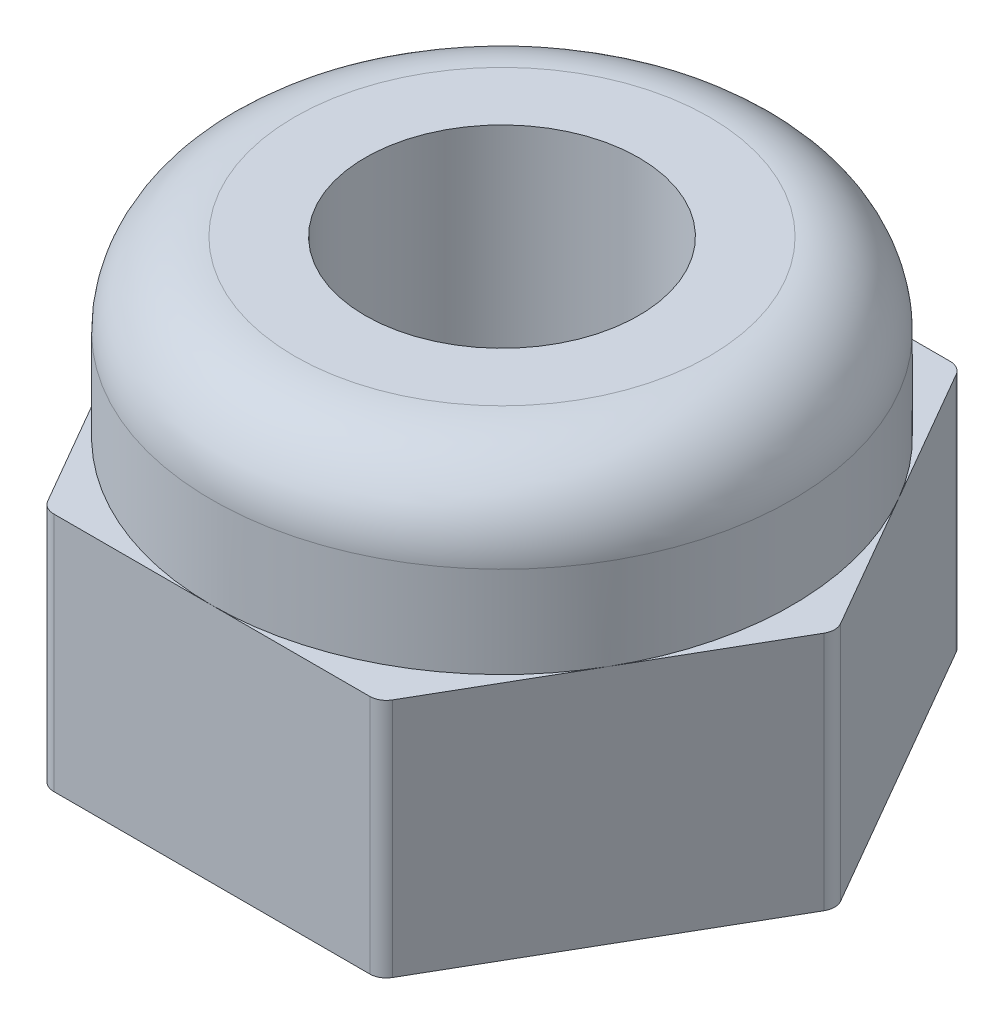
ISO-10303-21;
HEADER;
FILE_DESCRIPTION(('STEP AP214'),'2;1');
FILE_NAME('part.step','',(''),(''),'','','');
FILE_SCHEMA(('AUTOMOTIVE_DESIGN { 1 0 10303 214 1 1 1 1 }'));
ENDSEC;
DATA;
#1=APPLICATION_CONTEXT('core data for automotive mechanical design processes');
#2=APPLICATION_PROTOCOL_DEFINITION('international standard','automotive_design',2000,#1);
#3=PRODUCT_CONTEXT('',#1,'mechanical');
#4=PRODUCT('Part','Part','',(#3));
#5=PRODUCT_RELATED_PRODUCT_CATEGORY('part','',(#4));
#6=PRODUCT_DEFINITION_FORMATION('','',#4);
#7=PRODUCT_DEFINITION_CONTEXT('part definition',#1,'design');
#8=PRODUCT_DEFINITION('design','',#6,#7);
#9=PRODUCT_DEFINITION_SHAPE('','',#8);
#10=(LENGTH_UNIT() NAMED_UNIT(*) SI_UNIT(.MILLI.,.METRE.));
#11=(NAMED_UNIT(*) PLANE_ANGLE_UNIT() SI_UNIT($,.RADIAN.));
#12=(NAMED_UNIT(*) SI_UNIT($,.STERADIAN.) SOLID_ANGLE_UNIT());
#13=UNCERTAINTY_MEASURE_WITH_UNIT(LENGTH_MEASURE(1.E-05),#10,'distance_accuracy_value','');
#14=(GEOMETRIC_REPRESENTATION_CONTEXT(3) GLOBAL_UNCERTAINTY_ASSIGNED_CONTEXT((#13)) GLOBAL_UNIT_ASSIGNED_CONTEXT((#10,
#11,#12)) REPRESENTATION_CONTEXT('',''));
#15=CARTESIAN_POINT('',(0.,0.,0.));
#16=DIRECTION('',(0.,0.,1.));
#17=DIRECTION('',(1.,0.,0.));
#18=AXIS2_PLACEMENT_3D('',#15,#16,#17);
#19=CARTESIAN_POINT('',(0.,2.9,0.));
#20=DIRECTION('',(0.,1.,0.));
#21=DIRECTION('',(0.,0.,1.));
#22=AXIS2_PLACEMENT_3D('',#19,#20,#21);
#23=PLANE('',#22);
#24=DIRECTION('',(1.,0.,0.));
#25=VECTOR('',#24,1.);
#26=CARTESIAN_POINT('',(-2.02072594216366,2.9,3.50000000000002));
#27=LINE('',#26,#25);
#28=CARTESIAN_POINT('',(0.,2.9,3.5));
#29=VERTEX_POINT('',#28);
#30=CARTESIAN_POINT('',(1.90525588832581,2.9,3.49999999999998));
#31=VERTEX_POINT('',#30);
#32=EDGE_CURVE('E159',#29,#31,#27,.T.);
#33=ORIENTED_EDGE('',*,*,#32,.T.);
#34=CARTESIAN_POINT('',(1.90525588832581,2.9,3.29999999999998));
#35=DIRECTION('',(0.,1.,0.));
#36=DIRECTION('',(0.,0.,1.));
#37=AXIS2_PLACEMENT_3D('',#34,#35,#36);
#38=CIRCLE('',#37,0.2);
#39=CARTESIAN_POINT('',(2.07846096908269,2.9,3.39999999999998));
#40=VERTEX_POINT('',#39);
#41=EDGE_CURVE('E11',#31,#40,#38,.T.);
#42=ORIENTED_EDGE('',*,*,#41,.T.);
#43=DIRECTION('',(0.499999999999995,0.,-0.866025403784442));
#44=VECTOR('',#43,1.);
#45=CARTESIAN_POINT('',(2.02072594216373,2.9,3.49999999999998));
#46=LINE('',#45,#44);
#47=CARTESIAN_POINT('',(3.03108891324556,2.9,1.74999999999999));
#48=VERTEX_POINT('',#47);
#49=EDGE_CURVE('E169',#40,#48,#46,.T.);
#50=ORIENTED_EDGE('',*,*,#49,.T.);
#51=CARTESIAN_POINT('',(0.,2.9,0.));
#52=DIRECTION('',(0.,1.,0.));
#53=DIRECTION('',(0.,0.,1.));
#54=AXIS2_PLACEMENT_3D('',#51,#52,#53);
#55=CIRCLE('',#54,3.50000000000002);
#56=EDGE_CURVE('E168',#29,#48,#55,.T.);
#57=ORIENTED_EDGE('',*,*,#56,.F.);
#58=EDGE_LOOP('',(#33,#42,#50,#57));
#59=FACE_BOUND('',#58,.T.);
#60=ADVANCED_FACE('F38',(#59),#23,.T.);
#61=CARTESIAN_POINT('',(3.98371685740842,2.9,0.0999999999999994));
#62=VERTEX_POINT('',#61);
#63=EDGE_CURVE('E190',#48,#62,#46,.T.);
#64=ORIENTED_EDGE('',*,*,#63,.T.);
#65=CARTESIAN_POINT('',(3.81051177665153,2.9,0.));
#66=DIRECTION('',(0.,1.,0.));
#67=DIRECTION('',(0.,0.,1.));
#68=AXIS2_PLACEMENT_3D('',#65,#66,#67);
#69=CIRCLE('',#68,0.2);
#70=CARTESIAN_POINT('',(3.98371685740842,2.9,-0.0999999999999996));
#71=VERTEX_POINT('',#70);
#72=EDGE_CURVE('E46',#62,#71,#69,.T.);
#73=ORIENTED_EDGE('',*,*,#72,.T.);
#74=DIRECTION('',(-0.500000000000001,0.,-0.866025403784438));
#75=VECTOR('',#74,1.);
#76=CARTESIAN_POINT('',(4.04145188432738,2.9,0.));
#77=LINE('',#76,#75);
#78=CARTESIAN_POINT('',(3.03108891324553,2.9,-1.75));
#79=VERTEX_POINT('',#78);
#80=EDGE_CURVE('E191',#71,#79,#77,.T.);
#81=ORIENTED_EDGE('',*,*,#80,.T.);
#82=EDGE_CURVE('E174',#48,#79,#55,.T.);
#83=ORIENTED_EDGE('',*,*,#82,.F.);
#84=EDGE_LOOP('',(#64,#73,#81,#83));
#85=FACE_BOUND('',#84,.T.);
#86=ADVANCED_FACE('F269',(#85),#23,.T.);
#87=CARTESIAN_POINT('',(2.07846096908265,2.9,-3.40000000000001));
#88=VERTEX_POINT('',#87);
#89=EDGE_CURVE('E189',#79,#88,#77,.T.);
#90=ORIENTED_EDGE('',*,*,#89,.T.);
#91=CARTESIAN_POINT('',(1.90525588832576,2.9,-3.30000000000001));
#92=DIRECTION('',(0.,1.,0.));
#93=DIRECTION('',(0.,0.,1.));
#94=AXIS2_PLACEMENT_3D('',#91,#92,#93);
#95=CIRCLE('',#94,0.2);
#96=CARTESIAN_POINT('',(1.90525588832576,2.9,-3.50000000000001));
#97=VERTEX_POINT('',#96);
#98=EDGE_CURVE('E261',#88,#97,#95,.T.);
#99=ORIENTED_EDGE('',*,*,#98,.T.);
#100=DIRECTION('',(-1.,0.,0.));
#101=VECTOR('',#100,1.);
#102=CARTESIAN_POINT('',(2.02072594216368,2.9,-3.50000000000001));
#103=LINE('',#102,#101);
#104=CARTESIAN_POINT('',(0.,2.9,-3.5));
#105=VERTEX_POINT('',#104);
#106=EDGE_CURVE('E194',#97,#105,#103,.T.);
#107=ORIENTED_EDGE('',*,*,#106,.T.);
#108=EDGE_CURVE('E323',#79,#105,#55,.T.);
#109=ORIENTED_EDGE('',*,*,#108,.F.);
#110=EDGE_LOOP('',(#90,#99,#107,#109));
#111=FACE_BOUND('',#110,.T.);
#112=ADVANCED_FACE('F321',(#111),#23,.T.);
#113=CARTESIAN_POINT('',(-1.90525588832578,2.9,-3.49999999999999));
#114=VERTEX_POINT('',#113);
#115=EDGE_CURVE('E193',#105,#114,#103,.T.);
#116=ORIENTED_EDGE('',*,*,#115,.T.);
#117=CARTESIAN_POINT('',(-1.90525588832578,2.9,-3.29999999999999));
#118=DIRECTION('',(0.,1.,0.));
#119=DIRECTION('',(0.,0.,1.));
#120=AXIS2_PLACEMENT_3D('',#117,#118,#119);
#121=CIRCLE('',#120,0.2);
#122=CARTESIAN_POINT('',(-2.07846096908267,2.9,-3.39999999999999));
#123=VERTEX_POINT('',#122);
#124=EDGE_CURVE('E254',#114,#123,#121,.T.);
#125=ORIENTED_EDGE('',*,*,#124,.T.);
#126=DIRECTION('',(-0.499999999999995,0.,0.866025403784442));
#127=VECTOR('',#126,1.);
#128=CARTESIAN_POINT('',(-2.02072594216371,2.9,-3.49999999999999));
#129=LINE('',#128,#127);
#130=CARTESIAN_POINT('',(-3.03108891324555,2.9,-1.74999999999998));
#131=VERTEX_POINT('',#130);
#132=EDGE_CURVE('E197',#123,#131,#129,.T.);
#133=ORIENTED_EDGE('',*,*,#132,.T.);
#134=EDGE_CURVE('E182',#105,#131,#55,.T.);
#135=ORIENTED_EDGE('',*,*,#134,.F.);
#136=EDGE_LOOP('',(#116,#125,#133,#135));
#137=FACE_BOUND('',#136,.T.);
#138=ADVANCED_FACE('F326',(#137),#23,.T.);
#139=CARTESIAN_POINT('',(-3.98371685740842,2.9,-0.0999999999999729));
#140=VERTEX_POINT('',#139);
#141=EDGE_CURVE('E196',#131,#140,#129,.T.);
#142=ORIENTED_EDGE('',*,*,#141,.T.);
#143=CARTESIAN_POINT('',(-3.81051177665153,2.9,0.));
#144=DIRECTION('',(0.,1.,0.));
#145=DIRECTION('',(0.,0.,1.));
#146=AXIS2_PLACEMENT_3D('',#143,#144,#145);
#147=CIRCLE('',#146,0.2);
#148=CARTESIAN_POINT('',(-3.98371685740842,2.9,0.100000000000028));
#149=VERTEX_POINT('',#148);
#150=EDGE_CURVE('E247',#140,#149,#147,.T.);
#151=ORIENTED_EDGE('',*,*,#150,.T.);
#152=DIRECTION('',(0.500000000000007,0.,0.866025403784435));
#153=VECTOR('',#152,1.);
#154=CARTESIAN_POINT('',(-4.04145188432738,2.9,0.));
#155=LINE('',#154,#153);
#156=CARTESIAN_POINT('',(-3.03108891324552,2.9,1.75000000000002));
#157=VERTEX_POINT('',#156);
#158=EDGE_CURVE('E166',#149,#157,#155,.T.);
#159=ORIENTED_EDGE('',*,*,#158,.T.);
#160=EDGE_CURVE('E180',#131,#157,#55,.T.);
#161=ORIENTED_EDGE('',*,*,#160,.F.);
#162=EDGE_LOOP('',(#142,#151,#159,#161));
#163=FACE_BOUND('',#162,.T.);
#164=ADVANCED_FACE('F328',(#163),#23,.T.);
#165=CARTESIAN_POINT('',(2.02072594216373,2.9,3.49999999999998));
#166=DIRECTION('',(-0.866025403784442,0.,-0.499999999999995));
#167=DIRECTION('',(-0.499999999999995,0.,0.866025403784442));
#168=AXIS2_PLACEMENT_3D('',#165,#166,#167);
#169=PLANE('',#168);
#170=DIRECTION('',(0.499999999999995,0.,-0.866025403784442));
#171=VECTOR('',#170,1.);
#172=CARTESIAN_POINT('',(2.02072594216373,0.,3.49999999999998));
#173=LINE('',#172,#171);
#174=CARTESIAN_POINT('',(2.07846096908269,0.,3.39999999999998));
#175=VERTEX_POINT('',#174);
#176=CARTESIAN_POINT('',(3.98371685740842,0.,0.0999999999999994));
#177=VERTEX_POINT('',#176);
#178=EDGE_CURVE('E173',#175,#177,#173,.T.);
#179=ORIENTED_EDGE('',*,*,#178,.T.);
#180=DIRECTION('',(0.,-1.,0.));
#181=VECTOR('',#180,1.);
#182=CARTESIAN_POINT('',(3.98371685740842,2.9,0.0999999999999994));
#183=LINE('',#182,#181);
#184=EDGE_CURVE('E59',#177,#62,#183,.F.);
#185=ORIENTED_EDGE('',*,*,#184,.T.);
#186=ORIENTED_EDGE('',*,*,#63,.F.);
#187=ORIENTED_EDGE('',*,*,#49,.F.);
#188=DIRECTION('',(0.,-1.,0.));
#189=VECTOR('',#188,1.);
#190=CARTESIAN_POINT('',(2.07846096908269,2.9,3.39999999999998));
#191=LINE('',#190,#189);
#192=EDGE_CURVE('E263',#40,#175,#191,.T.);
#193=ORIENTED_EDGE('',*,*,#192,.T.);
#194=EDGE_LOOP('',(#179,#185,#186,#187,#193));
#195=FACE_BOUND('',#194,.T.);
#196=ADVANCED_FACE('F283',(#195),#169,.F.);
#197=CARTESIAN_POINT('',(4.04145188432738,2.9,0.));
#198=DIRECTION('',(-0.866025403784438,0.,0.500000000000001));
#199=DIRECTION('',(0.500000000000001,0.,0.866025403784438));
#200=AXIS2_PLACEMENT_3D('',#197,#198,#199);
#201=PLANE('',#200);
#202=DIRECTION('',(-0.500000000000001,0.,-0.866025403784438));
#203=VECTOR('',#202,1.);
#204=CARTESIAN_POINT('',(4.04145188432738,0.,0.));
#205=LINE('',#204,#203);
#206=CARTESIAN_POINT('',(3.98371685740842,0.,-0.0999999999999996));
#207=VERTEX_POINT('',#206);
#208=CARTESIAN_POINT('',(2.07846096908265,0.,-3.40000000000001));
#209=VERTEX_POINT('',#208);
#210=EDGE_CURVE('E202',#207,#209,#205,.T.);
#211=ORIENTED_EDGE('',*,*,#210,.T.);
#212=DIRECTION('',(0.,-1.,0.));
#213=VECTOR('',#212,1.);
#214=CARTESIAN_POINT('',(2.07846096908265,2.9,-3.40000000000001));
#215=LINE('',#214,#213);
#216=EDGE_CURVE('E259',#209,#88,#215,.F.);
#217=ORIENTED_EDGE('',*,*,#216,.T.);
#218=ORIENTED_EDGE('',*,*,#89,.F.);
#219=ORIENTED_EDGE('',*,*,#80,.F.);
#220=DIRECTION('',(0.,-1.,0.));
#221=VECTOR('',#220,1.);
#222=CARTESIAN_POINT('',(3.98371685740842,2.9,-0.0999999999999996));
#223=LINE('',#222,#221);
#224=EDGE_CURVE('E256',#71,#207,#223,.T.);
#225=ORIENTED_EDGE('',*,*,#224,.T.);
#226=EDGE_LOOP('',(#211,#217,#218,#219,#225));
#227=FACE_BOUND('',#226,.T.);
#228=ADVANCED_FACE('F275',(#227),#201,.F.);
#229=CARTESIAN_POINT('',(2.02072594216368,2.9,-3.50000000000001));
#230=DIRECTION('',(0.,0.,1.));
#231=DIRECTION('',(1.,0.,0.));
#232=AXIS2_PLACEMENT_3D('',#229,#230,#231);
#233=PLANE('',#232);
#234=DIRECTION('',(-1.,0.,0.));
#235=VECTOR('',#234,1.);
#236=CARTESIAN_POINT('',(2.02072594216368,0.,-3.50000000000001));
#237=LINE('',#236,#235);
#238=CARTESIAN_POINT('',(1.90525588832576,0.,-3.50000000000001));
#239=VERTEX_POINT('',#238);
#240=CARTESIAN_POINT('',(-1.90525588832578,0.,-3.49999999999999));
#241=VERTEX_POINT('',#240);
#242=EDGE_CURVE('E205',#239,#241,#237,.T.);
#243=ORIENTED_EDGE('',*,*,#242,.T.);
#244=DIRECTION('',(0.,-1.,0.));
#245=VECTOR('',#244,1.);
#246=CARTESIAN_POINT('',(-1.90525588832578,2.9,-3.49999999999999));
#247=LINE('',#246,#245);
#248=EDGE_CURVE('E252',#241,#114,#247,.F.);
#249=ORIENTED_EDGE('',*,*,#248,.T.);
#250=ORIENTED_EDGE('',*,*,#115,.F.);
#251=ORIENTED_EDGE('',*,*,#106,.F.);
#252=DIRECTION('',(0.,-1.,0.));
#253=VECTOR('',#252,1.);
#254=CARTESIAN_POINT('',(1.90525588832576,2.9,-3.50000000000001));
#255=LINE('',#254,#253);
#256=EDGE_CURVE('E249',#97,#239,#255,.T.);
#257=ORIENTED_EDGE('',*,*,#256,.T.);
#258=EDGE_LOOP('',(#243,#249,#250,#251,#257));
#259=FACE_BOUND('',#258,.T.);
#260=ADVANCED_FACE('F311',(#259),#233,.F.);
#261=CARTESIAN_POINT('',(-2.02072594216371,2.9,-3.49999999999999));
#262=DIRECTION('',(0.866025403784442,0.,0.499999999999995));
#263=DIRECTION('',(0.499999999999995,0.,-0.866025403784442));
#264=AXIS2_PLACEMENT_3D('',#261,#262,#263);
#265=PLANE('',#264);
#266=DIRECTION('',(-0.499999999999995,0.,0.866025403784442));
#267=VECTOR('',#266,1.);
#268=CARTESIAN_POINT('',(-2.02072594216371,0.,-3.49999999999999));
#269=LINE('',#268,#267);
#270=CARTESIAN_POINT('',(-2.07846096908267,0.,-3.39999999999999));
#271=VERTEX_POINT('',#270);
#272=CARTESIAN_POINT('',(-3.98371685740842,0.,-0.0999999999999729));
#273=VERTEX_POINT('',#272);
#274=EDGE_CURVE('E208',#271,#273,#269,.T.);
#275=ORIENTED_EDGE('',*,*,#274,.T.);
#276=DIRECTION('',(0.,-1.,0.));
#277=VECTOR('',#276,1.);
#278=CARTESIAN_POINT('',(-3.98371685740842,2.9,-0.0999999999999725));
#279=LINE('',#278,#277);
#280=EDGE_CURVE('E245',#273,#140,#279,.F.);
#281=ORIENTED_EDGE('',*,*,#280,.T.);
#282=ORIENTED_EDGE('',*,*,#141,.F.);
#283=ORIENTED_EDGE('',*,*,#132,.F.);
#284=DIRECTION('',(0.,-1.,0.));
#285=VECTOR('',#284,1.);
#286=CARTESIAN_POINT('',(-2.07846096908267,2.9,-3.39999999999999));
#287=LINE('',#286,#285);
#288=EDGE_CURVE('E242',#123,#271,#287,.T.);
#289=ORIENTED_EDGE('',*,*,#288,.T.);
#290=EDGE_LOOP('',(#275,#281,#282,#283,#289));
#291=FACE_BOUND('',#290,.T.);
#292=ADVANCED_FACE('F300',(#291),#265,.F.);
#293=CARTESIAN_POINT('',(-4.04145188432738,2.9,0.));
#294=DIRECTION('',(0.866025403784435,0.,-0.500000000000007));
#295=DIRECTION('',(-0.500000000000007,0.,-0.866025403784434));
#296=AXIS2_PLACEMENT_3D('',#293,#294,#295);
#297=PLANE('',#296);
#298=DIRECTION('',(0.500000000000007,0.,0.866025403784435));
#299=VECTOR('',#298,1.);
#300=CARTESIAN_POINT('',(-4.04145188432738,0.,0.));
#301=LINE('',#300,#299);
#302=CARTESIAN_POINT('',(-3.98371685740842,0.,0.100000000000028));
#303=VERTEX_POINT('',#302);
#304=CARTESIAN_POINT('',(-2.07846096908262,0.,3.40000000000002));
#305=VERTEX_POINT('',#304);
#306=EDGE_CURVE('E211',#303,#305,#301,.T.);
#307=ORIENTED_EDGE('',*,*,#306,.T.);
#308=DIRECTION('',(0.,-1.,0.));
#309=VECTOR('',#308,1.);
#310=CARTESIAN_POINT('',(-2.07846096908262,2.9,3.40000000000002));
#311=LINE('',#310,#309);
#312=CARTESIAN_POINT('',(-2.07846096908262,2.9,3.40000000000002));
#313=VERTEX_POINT('',#312);
#314=EDGE_CURVE('E239',#305,#313,#311,.F.);
#315=ORIENTED_EDGE('',*,*,#314,.T.);
#316=EDGE_CURVE('E199',#157,#313,#155,.T.);
#317=ORIENTED_EDGE('',*,*,#316,.F.);
#318=ORIENTED_EDGE('',*,*,#158,.F.);
#319=DIRECTION('',(0.,-1.,0.));
#320=VECTOR('',#319,1.);
#321=CARTESIAN_POINT('',(-3.98371685740842,2.9,0.100000000000028));
#322=LINE('',#321,#320);
#323=EDGE_CURVE('E236',#149,#303,#322,.T.);
#324=ORIENTED_EDGE('',*,*,#323,.T.);
#325=EDGE_LOOP('',(#307,#315,#317,#318,#324));
#326=FACE_BOUND('',#325,.T.);
#327=ADVANCED_FACE('F291',(#326),#297,.F.);
#328=CARTESIAN_POINT('',(-2.02072594216366,2.9,3.50000000000002));
#329=DIRECTION('',(0.,0.,-1.));
#330=DIRECTION('',(-1.,0.,0.));
#331=AXIS2_PLACEMENT_3D('',#328,#329,#330);
#332=PLANE('',#331);
#333=CARTESIAN_POINT('',(-1.90525588832573,2.9,3.50000000000002));
#334=VERTEX_POINT('',#333);
#335=EDGE_CURVE('E146',#334,#29,#27,.T.);
#336=ORIENTED_EDGE('',*,*,#335,.F.);
#337=DIRECTION('',(0.,-1.,0.));
#338=VECTOR('',#337,1.);
#339=CARTESIAN_POINT('',(-1.90525588832573,2.9,3.50000000000002));
#340=LINE('',#339,#338);
#341=CARTESIAN_POINT('',(-1.90525588832573,0.,3.50000000000002));
#342=VERTEX_POINT('',#341);
#343=EDGE_CURVE('E222',#334,#342,#340,.T.);
#344=ORIENTED_EDGE('',*,*,#343,.T.);
#345=DIRECTION('',(1.,0.,0.));
#346=VECTOR('',#345,1.);
#347=CARTESIAN_POINT('',(-2.02072594216366,0.,3.50000000000002));
#348=LINE('',#347,#346);
#349=CARTESIAN_POINT('',(1.90525588832581,0.,3.49999999999998));
#350=VERTEX_POINT('',#349);
#351=EDGE_CURVE('E214',#342,#350,#348,.T.);
#352=ORIENTED_EDGE('',*,*,#351,.T.);
#353=DIRECTION('',(0.,-1.,0.));
#354=VECTOR('',#353,1.);
#355=CARTESIAN_POINT('',(1.90525588832581,2.9,3.49999999999998));
#356=LINE('',#355,#354);
#357=EDGE_CURVE('E165',#350,#31,#356,.F.);
#358=ORIENTED_EDGE('',*,*,#357,.T.);
#359=ORIENTED_EDGE('',*,*,#32,.F.);
#360=EDGE_LOOP('',(#336,#344,#352,#358,#359));
#361=FACE_BOUND('',#360,.T.);
#362=ADVANCED_FACE('F162',(#361),#332,.F.);
#363=ORIENTED_EDGE('',*,*,#316,.T.);
#364=CARTESIAN_POINT('',(-1.90525588832574,2.9,3.30000000000002));
#365=DIRECTION('',(0.,1.,0.));
#366=DIRECTION('',(0.,0.,1.));
#367=AXIS2_PLACEMENT_3D('',#364,#365,#366);
#368=CIRCLE('',#367,0.2);
#369=EDGE_CURVE('E154',#313,#334,#368,.T.);
#370=ORIENTED_EDGE('',*,*,#369,.T.);
#371=ORIENTED_EDGE('',*,*,#335,.T.);
#372=EDGE_CURVE('E151',#157,#29,#55,.T.);
#373=ORIENTED_EDGE('',*,*,#372,.F.);
#374=EDGE_LOOP('',(#363,#370,#371,#373));
#375=FACE_BOUND('',#374,.T.);
#376=ADVANCED_FACE('F149',(#375),#23,.T.);
#377=CARTESIAN_POINT('',(0.,0.,0.));
#378=DIRECTION('',(0.,1.,0.));
#379=DIRECTION('',(0.,0.,1.));
#380=AXIS2_PLACEMENT_3D('',#377,#378,#379);
#381=PLANE('',#380);
#382=CARTESIAN_POINT('',(0.,0.,0.));
#383=DIRECTION('',(0.,-1.,0.));
#384=DIRECTION('',(0.,0.,-1.));
#385=AXIS2_PLACEMENT_3D('',#382,#383,#384);
#386=CIRCLE('',#385,1.64999999999999);
#387=CARTESIAN_POINT('',(0.,0.,-1.64999999999999));
#388=VERTEX_POINT('',#387);
#389=EDGE_CURVE('E184',#388,#388,#386,.T.);
#390=ORIENTED_EDGE('',*,*,#389,.F.);
#391=EDGE_LOOP('',(#390));
#392=FACE_BOUND('',#391,.T.);
#393=ORIENTED_EDGE('',*,*,#351,.F.);
#394=CARTESIAN_POINT('',(-1.90525588832574,0.,3.30000000000002));
#395=DIRECTION('',(0.,1.,0.));
#396=DIRECTION('',(0.,0.,1.));
#397=AXIS2_PLACEMENT_3D('',#394,#395,#396);
#398=CIRCLE('',#397,0.2);
#399=EDGE_CURVE('E234',#342,#305,#398,.F.);
#400=ORIENTED_EDGE('',*,*,#399,.T.);
#401=ORIENTED_EDGE('',*,*,#306,.F.);
#402=CARTESIAN_POINT('',(-3.81051177665153,0.,0.));
#403=DIRECTION('',(0.,1.,0.));
#404=DIRECTION('',(0.,0.,1.));
#405=AXIS2_PLACEMENT_3D('',#402,#403,#404);
#406=CIRCLE('',#405,0.2);
#407=EDGE_CURVE('E232',#303,#273,#406,.F.);
#408=ORIENTED_EDGE('',*,*,#407,.T.);
#409=ORIENTED_EDGE('',*,*,#274,.F.);
#410=CARTESIAN_POINT('',(-1.90525588832578,0.,-3.29999999999999));
#411=DIRECTION('',(0.,1.,0.));
#412=DIRECTION('',(0.,0.,1.));
#413=AXIS2_PLACEMENT_3D('',#410,#411,#412);
#414=CIRCLE('',#413,0.2);
#415=EDGE_CURVE('E230',#271,#241,#414,.F.);
#416=ORIENTED_EDGE('',*,*,#415,.T.);
#417=ORIENTED_EDGE('',*,*,#242,.F.);
#418=CARTESIAN_POINT('',(1.90525588832576,0.,-3.30000000000001));
#419=DIRECTION('',(0.,1.,0.));
#420=DIRECTION('',(0.,0.,1.));
#421=AXIS2_PLACEMENT_3D('',#418,#419,#420);
#422=CIRCLE('',#421,0.2);
#423=EDGE_CURVE('E228',#239,#209,#422,.F.);
#424=ORIENTED_EDGE('',*,*,#423,.T.);
#425=ORIENTED_EDGE('',*,*,#210,.F.);
#426=CARTESIAN_POINT('',(3.81051177665153,0.,0.));
#427=DIRECTION('',(0.,1.,0.));
#428=DIRECTION('',(0.,0.,1.));
#429=AXIS2_PLACEMENT_3D('',#426,#427,#428);
#430=CIRCLE('',#429,0.2);
#431=EDGE_CURVE('E226',#207,#177,#430,.F.);
#432=ORIENTED_EDGE('',*,*,#431,.T.);
#433=ORIENTED_EDGE('',*,*,#178,.F.);
#434=CARTESIAN_POINT('',(1.90525588832581,0.,3.29999999999998));
#435=DIRECTION('',(0.,1.,0.));
#436=DIRECTION('',(0.,0.,1.));
#437=AXIS2_PLACEMENT_3D('',#434,#435,#436);
#438=CIRCLE('',#437,0.2);
#439=EDGE_CURVE('E224',#175,#350,#438,.F.);
#440=ORIENTED_EDGE('',*,*,#439,.T.);
#441=EDGE_LOOP('',(#393,#400,#401,#408,#409,#416,#417,#424,#425,#432,#433,#440));
#442=FACE_BOUND('',#441,.T.);
#443=ADVANCED_FACE('F282',(#392,#442),#381,.F.);
#444=CARTESIAN_POINT('',(0.,5.,0.));
#445=DIRECTION('',(0.,-1.,0.));
#446=DIRECTION('',(0.,0.,-1.));
#447=AXIS2_PLACEMENT_3D('',#444,#445,#446);
#448=CYLINDRICAL_SURFACE('',#447,3.50000000000002);
#449=CARTESIAN_POINT('',(0.,4.,0.));
#450=DIRECTION('',(0.,-1.,0.));
#451=DIRECTION('',(0.,0.,-1.));
#452=AXIS2_PLACEMENT_3D('',#449,#450,#451);
#453=CIRCLE('',#452,3.50000000000002);
#454=CARTESIAN_POINT('',(0.,4.,-3.50000000000002));
#455=VERTEX_POINT('',#454);
#456=EDGE_CURVE('E158',#455,#455,#453,.T.);
#457=ORIENTED_EDGE('',*,*,#456,.T.);
#458=EDGE_LOOP('',(#457));
#459=FACE_BOUND('',#458,.T.);
#460=ORIENTED_EDGE('',*,*,#372,.T.);
#461=ORIENTED_EDGE('',*,*,#56,.T.);
#462=ORIENTED_EDGE('',*,*,#82,.T.);
#463=ORIENTED_EDGE('',*,*,#108,.T.);
#464=ORIENTED_EDGE('',*,*,#134,.T.);
#465=ORIENTED_EDGE('',*,*,#160,.T.);
#466=EDGE_LOOP('',(#460,#461,#462,#463,#464,#465));
#467=FACE_BOUND('',#466,.T.);
#468=ADVANCED_FACE('F177',(#459,#467),#448,.T.);
#469=CARTESIAN_POINT('',(0.,5.,0.));
#470=DIRECTION('',(0.,-1.,0.));
#471=DIRECTION('',(0.,0.,-1.));
#472=AXIS2_PLACEMENT_3D('',#469,#470,#471);
#473=PLANE('',#472);
#474=CARTESIAN_POINT('',(0.,5.,0.));
#475=DIRECTION('',(0.,-1.,0.));
#476=DIRECTION('',(0.,0.,-1.));
#477=AXIS2_PLACEMENT_3D('',#474,#475,#476);
#478=CIRCLE('',#477,1.65);
#479=CARTESIAN_POINT('',(0.,5.,-1.65));
#480=VERTEX_POINT('',#479);
#481=EDGE_CURVE('E181',#480,#480,#478,.T.);
#482=ORIENTED_EDGE('',*,*,#481,.T.);
#483=EDGE_LOOP('',(#482));
#484=FACE_BOUND('',#483,.T.);
#485=CARTESIAN_POINT('',(0.,5.,0.));
#486=DIRECTION('',(0.,-1.,0.));
#487=DIRECTION('',(0.,0.,-1.));
#488=AXIS2_PLACEMENT_3D('',#485,#486,#487);
#489=CIRCLE('',#488,2.50000000000002);
#490=CARTESIAN_POINT('',(0.,5.,-2.50000000000002));
#491=VERTEX_POINT('',#490);
#492=EDGE_CURVE('E218',#491,#491,#489,.F.);
#493=ORIENTED_EDGE('',*,*,#492,.T.);
#494=EDGE_LOOP('',(#493));
#495=FACE_BOUND('',#494,.T.);
#496=ADVANCED_FACE('F475',(#484,#495),#473,.F.);
#497=CARTESIAN_POINT('',(0.,4.,0.));
#498=DIRECTION('',(0.,-1.,0.));
#499=DIRECTION('',(0.,0.,-1.));
#500=AXIS2_PLACEMENT_3D('',#497,#498,#499);
#501=TOROIDAL_SURFACE('',#500,2.50000000000002,1.);
#502=ORIENTED_EDGE('',*,*,#492,.F.);
#503=EDGE_LOOP('',(#502));
#504=FACE_BOUND('',#503,.T.);
#505=ORIENTED_EDGE('',*,*,#456,.F.);
#506=EDGE_LOOP('',(#505));
#507=FACE_BOUND('',#506,.T.);
#508=ADVANCED_FACE('F419',(#504,#507),#501,.T.);
#509=CARTESIAN_POINT('',(-1.90525588832574,2.9,3.30000000000002));
#510=DIRECTION('',(0.,-1.,0.));
#511=DIRECTION('',(0.,0.,-1.));
#512=AXIS2_PLACEMENT_3D('',#509,#510,#511);
#513=CYLINDRICAL_SURFACE('',#512,0.2);
#514=ORIENTED_EDGE('',*,*,#369,.F.);
#515=ORIENTED_EDGE('',*,*,#314,.F.);
#516=ORIENTED_EDGE('',*,*,#399,.F.);
#517=ORIENTED_EDGE('',*,*,#343,.F.);
#518=EDGE_LOOP('',(#514,#515,#516,#517));
#519=FACE_BOUND('',#518,.T.);
#520=ADVANCED_FACE('F287',(#519),#513,.T.);
#521=CARTESIAN_POINT('',(-3.81051177665153,2.9,0.));
#522=DIRECTION('',(0.,-1.,0.));
#523=DIRECTION('',(0.,0.,-1.));
#524=AXIS2_PLACEMENT_3D('',#521,#522,#523);
#525=CYLINDRICAL_SURFACE('',#524,0.2);
#526=ORIENTED_EDGE('',*,*,#150,.F.);
#527=ORIENTED_EDGE('',*,*,#280,.F.);
#528=ORIENTED_EDGE('',*,*,#407,.F.);
#529=ORIENTED_EDGE('',*,*,#323,.F.);
#530=EDGE_LOOP('',(#526,#527,#528,#529));
#531=FACE_BOUND('',#530,.T.);
#532=ADVANCED_FACE('F296',(#531),#525,.T.);
#533=CARTESIAN_POINT('',(-1.90525588832578,2.9,-3.29999999999999));
#534=DIRECTION('',(0.,-1.,0.));
#535=DIRECTION('',(0.,0.,-1.));
#536=AXIS2_PLACEMENT_3D('',#533,#534,#535);
#537=CYLINDRICAL_SURFACE('',#536,0.2);
#538=ORIENTED_EDGE('',*,*,#124,.F.);
#539=ORIENTED_EDGE('',*,*,#248,.F.);
#540=ORIENTED_EDGE('',*,*,#415,.F.);
#541=ORIENTED_EDGE('',*,*,#288,.F.);
#542=EDGE_LOOP('',(#538,#539,#540,#541));
#543=FACE_BOUND('',#542,.T.);
#544=ADVANCED_FACE('F307',(#543),#537,.T.);
#545=CARTESIAN_POINT('',(1.90525588832576,2.9,-3.30000000000001));
#546=DIRECTION('',(0.,-1.,0.));
#547=DIRECTION('',(0.,0.,-1.));
#548=AXIS2_PLACEMENT_3D('',#545,#546,#547);
#549=CYLINDRICAL_SURFACE('',#548,0.2);
#550=ORIENTED_EDGE('',*,*,#98,.F.);
#551=ORIENTED_EDGE('',*,*,#216,.F.);
#552=ORIENTED_EDGE('',*,*,#423,.F.);
#553=ORIENTED_EDGE('',*,*,#256,.F.);
#554=EDGE_LOOP('',(#550,#551,#552,#553));
#555=FACE_BOUND('',#554,.T.);
#556=ADVANCED_FACE('F318',(#555),#549,.T.);
#557=CARTESIAN_POINT('',(3.81051177665153,2.9,0.));
#558=DIRECTION('',(0.,-1.,0.));
#559=DIRECTION('',(0.,0.,-1.));
#560=AXIS2_PLACEMENT_3D('',#557,#558,#559);
#561=CYLINDRICAL_SURFACE('',#560,0.2);
#562=ORIENTED_EDGE('',*,*,#72,.F.);
#563=ORIENTED_EDGE('',*,*,#184,.F.);
#564=ORIENTED_EDGE('',*,*,#431,.F.);
#565=ORIENTED_EDGE('',*,*,#224,.F.);
#566=EDGE_LOOP('',(#562,#563,#564,#565));
#567=FACE_BOUND('',#566,.T.);
#568=ADVANCED_FACE('F278',(#567),#561,.T.);
#569=CARTESIAN_POINT('',(1.90525588832581,2.9,3.29999999999998));
#570=DIRECTION('',(0.,-1.,0.));
#571=DIRECTION('',(0.,0.,-1.));
#572=AXIS2_PLACEMENT_3D('',#569,#570,#571);
#573=CYLINDRICAL_SURFACE('',#572,0.2);
#574=ORIENTED_EDGE('',*,*,#41,.F.);
#575=ORIENTED_EDGE('',*,*,#357,.F.);
#576=ORIENTED_EDGE('',*,*,#439,.F.);
#577=ORIENTED_EDGE('',*,*,#192,.F.);
#578=EDGE_LOOP('',(#574,#575,#576,#577));
#579=FACE_BOUND('',#578,.T.);
#580=ADVANCED_FACE('F40',(#579),#573,.T.);
#581=CARTESIAN_POINT('',(0.,0.,0.));
#582=DIRECTION('',(0.,-1.,0.));
#583=DIRECTION('',(0.,0.,-1.));
#584=AXIS2_PLACEMENT_3D('',#581,#582,#583);
#585=CYLINDRICAL_SURFACE('',#584,1.64999999999999);
#586=ORIENTED_EDGE('',*,*,#481,.F.);
#587=EDGE_LOOP('',(#586));
#588=FACE_BOUND('',#587,.T.);
#589=ORIENTED_EDGE('',*,*,#389,.T.);
#590=EDGE_LOOP('',(#589));
#591=FACE_BOUND('',#590,.T.);
#592=ADVANCED_FACE('F461',(#588,#591),#585,.F.);
#593=CLOSED_SHELL('',(#60,#86,#112,#138,#164,#196,#228,#260,#292,#327,#362,#376,#443,#468,#496,
#508,#520,#532,#544,#556,#568,#580,#592));
#594=MANIFOLD_SOLID_BREP('B2',#593);
#595=ADVANCED_BREP_SHAPE_REPRESENTATION('',(#18,#594),#14);
#596=SHAPE_DEFINITION_REPRESENTATION(#9,#595);
ENDSEC;
END-ISO-10303-21;
